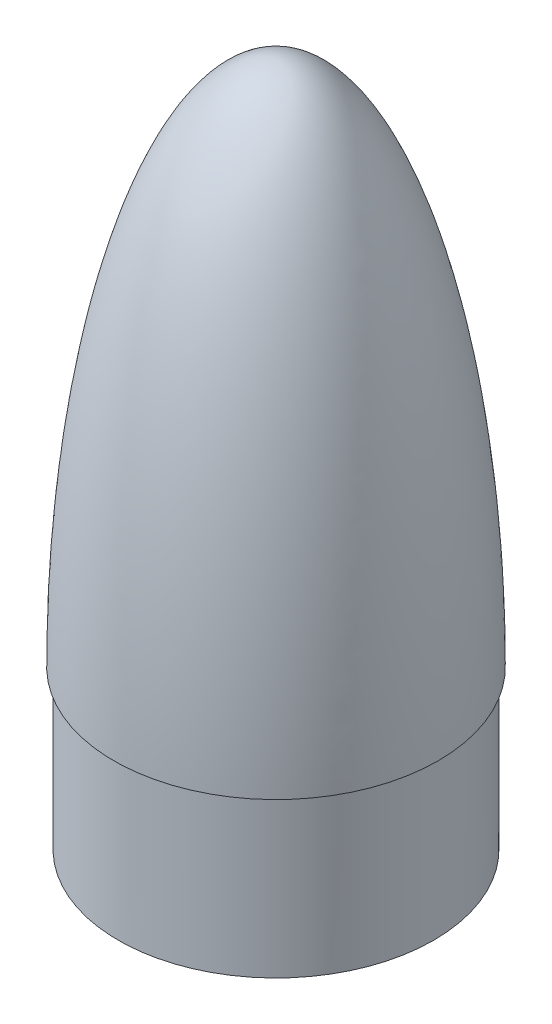
ISO-10303-21;
HEADER;
FILE_DESCRIPTION(('STEP AP214'),'2;1');
FILE_NAME('part.step','',(''),(''),'','','');
FILE_SCHEMA(('AUTOMOTIVE_DESIGN { 1 0 10303 214 1 1 1 1 }'));
ENDSEC;
DATA;
#1=APPLICATION_CONTEXT('core data for automotive mechanical design processes');
#2=APPLICATION_PROTOCOL_DEFINITION('international standard','automotive_design',2000,#1);
#3=PRODUCT_CONTEXT('',#1,'mechanical');
#4=PRODUCT('Part','Part','',(#3));
#5=PRODUCT_RELATED_PRODUCT_CATEGORY('part','',(#4));
#6=PRODUCT_DEFINITION_FORMATION('','',#4);
#7=PRODUCT_DEFINITION_CONTEXT('part definition',#1,'design');
#8=PRODUCT_DEFINITION('design','',#6,#7);
#9=PRODUCT_DEFINITION_SHAPE('','',#8);
#10=(LENGTH_UNIT() NAMED_UNIT(*) SI_UNIT(.MILLI.,.METRE.));
#11=(NAMED_UNIT(*) PLANE_ANGLE_UNIT() SI_UNIT($,.RADIAN.));
#12=(NAMED_UNIT(*) SI_UNIT($,.STERADIAN.) SOLID_ANGLE_UNIT());
#13=UNCERTAINTY_MEASURE_WITH_UNIT(LENGTH_MEASURE(1.E-05),#10,'distance_accuracy_value','');
#14=(GEOMETRIC_REPRESENTATION_CONTEXT(3) GLOBAL_UNCERTAINTY_ASSIGNED_CONTEXT((#13)) GLOBAL_UNIT_ASSIGNED_CONTEXT((#10,
#11,#12)) REPRESENTATION_CONTEXT('',''));
#15=CARTESIAN_POINT('',(0.,0.,0.));
#16=DIRECTION('',(0.,0.,1.));
#17=DIRECTION('',(1.,0.,0.));
#18=AXIS2_PLACEMENT_3D('',#15,#16,#17);
#19=CARTESIAN_POINT('',(78.359,-3.85523847188953E-12,0.));
#20=CARTESIAN_POINT('',(78.359,0.547287489075588,0.));
#21=CARTESIAN_POINT('',(78.3578456020913,1.64956361844569,0.));
#22=CARTESIAN_POINT('',(78.3526507757178,3.58634987510626,0.));
#23=CARTESIAN_POINT('',(78.3387963460281,5.98893459648296,0.));
#24=CARTESIAN_POINT('',(78.3180106719865,8.35221156862116,0.));
#25=CARTESIAN_POINT('',(78.2902889503954,10.7456008880464,0.));
#26=CARTESIAN_POINT('',(78.2469586970559,13.7314118256431,0.));
#27=CARTESIAN_POINT('',(78.1810613065712,17.3117033816035,0.));
#28=CARTESIAN_POINT('',(78.0838662599076,21.4904424666421,0.));
#29=CARTESIAN_POINT('',(77.9448220852113,26.2641170071195,0.));
#30=CARTESIAN_POINT('',(77.7776831858622,31.0375576311793,0.));
#31=CARTESIAN_POINT('',(77.5822913396883,35.809557456214,0.));
#32=CARTESIAN_POINT('',(77.358460438954,40.5805118631689,0.));
#33=CARTESIAN_POINT('',(77.0428534871404,46.5422862456611,0.));
#34=CARTESIAN_POINT('',(76.679080298482,52.501436143599,0.));
#35=CARTESIAN_POINT('',(76.2664485683162,58.4573591267082,0.));
#36=CARTESIAN_POINT('',(75.8041028056292,64.4096073987156,0.));
#37=CARTESIAN_POINT('',(75.4040152278983,69.1689496368718,0.));
#38=CARTESIAN_POINT('',(74.8656269280594,75.1147987012799,0.));
#39=CARTESIAN_POINT('',(74.1573857441951,82.2439739931216,0.));
#40=CARTESIAN_POINT('',(73.238266917693,90.5517309553179,0.));
#41=CARTESIAN_POINT('',(72.0557405970124,100.030771811018,0.));
#42=CARTESIAN_POINT('',(70.7355289433761,109.491671533595,0.));
#43=CARTESIAN_POINT('',(69.2709291178535,118.931305028362,0.));
#44=CARTESIAN_POINT('',(67.2499969191818,130.699881306212,0.));
#45=CARTESIAN_POINT('',(64.5017329483004,144.763840426727,0.));
#46=CARTESIAN_POINT('',(61.3085555382339,158.735984092255,0.));
#47=CARTESIAN_POINT('',(57.5910494958651,172.5772135738,0.));
#48=CARTESIAN_POINT('',(53.3830259383034,186.275905478581,0.));
#49=CARTESIAN_POINT('',(49.2387463120402,198.044837448618,0.));
#50=CARTESIAN_POINT('',(44.4832374304626,209.587335710993,0.));
#51=CARTESIAN_POINT('',(38.9428842352643,220.719241790241,0.));
#52=CARTESIAN_POINT('',(34.256173134855,228.693595393164,0.));
#53=CARTESIAN_POINT('',(29.8187102480322,235.095423042036,0.));
#54=CARTESIAN_POINT('',(25.6242497322616,240.182852142903,0.));
#55=CARTESIAN_POINT('',(21.9788928349695,243.926180276442,0.));
#56=CARTESIAN_POINT('',(18.5701501967581,246.859542722712,0.));
#57=CARTESIAN_POINT('',(15.4743490805522,249.076247660638,0.));
#58=CARTESIAN_POINT('',(12.5634057109101,250.785701438361,0.));
#59=CARTESIAN_POINT('',(9.77232736304578,252.083533870525,0.));
#60=CARTESIAN_POINT('',(7.06306970862824,253.028642362402,0.));
#61=CARTESIAN_POINT('',(4.27537380497181,253.686778480731,0.));
#62=CARTESIAN_POINT('',(2.18800688606533,253.939891173346,0.));
#63=CARTESIAN_POINT('',(0.767171585554602,253.999916554805,0.));
#64=CARTESIAN_POINT('',(0.,254.000000000081,0.));
#65=B_SPLINE_CURVE_WITH_KNOTS('',4,(#19,#20,#21,#22,#23,#24,#25,#26,#27,#28,#29,#30,#31,#32,#33,
#34,#35,#36,#37,#38,#39,#40,#41,#42,#43,#44,#45,#46,#47,#48,#49,#50,#51,#52,#53,#54,#55,#56,#57,
#58,#59,#60,#61,#62,#63,#64),.UNSPECIFIED.,.F.,.F.,(5,1,1,1,1,1,1,1,1,1,1,1,1,1,1,1,1,1,1,1,1,1,
1,1,1,1,1,1,1,1,1,1,1,1,1,1,1,1,1,1,1,1,5),(0.0832901678974378,0.0911196738198312,
0.0989491797422246,0.106778685664618,0.114608191587011,0.122437697509405,0.130267203431798,
0.145926215276585,0.161585227308661,0.177244239340738,0.192903251372814,0.208562263404891,
0.22422127500536,0.23988028660583,0.271198309806769,0.286857322025267,0.302516334243765,
0.318175346462263,0.333834358680761,0.365152382658847,0.396470406636932,0.427788430031848,
0.459106453426764,0.490424474288177,0.52174249514959,0.584378539310645,0.64701458132928,
0.678332609009811,0.709650636690343,0.772286631173186,0.810589211116004,0.841907031493423,
0.87260750281029,0.893486158308834,0.912628449807464,0.928287273750051,0.941044947751305,
0.952387223266141,0.962498308196118,0.972496120469674,0.981348672389275,0.98994985578346,1.),.UNSPECIFIED.);
#66=CARTESIAN_POINT('',(0.,254.000000000081,0.));
#67=DIRECTION('',(0.,1.,0.));
#68=AXIS1_PLACEMENT('',#66,#67);
#69=SURFACE_OF_REVOLUTION('',#65,#68);
#70=CARTESIAN_POINT('',(0.,254.000000000081,0.));
#71=VERTEX_POINT('',#70);
#72=VERTEX_LOOP('',#71);
#73=FACE_BOUND('',#72,.T.);
#74=CARTESIAN_POINT('',(0.,0.,0.));
#75=DIRECTION('',(0.,1.,0.));
#76=DIRECTION('',(-1.,0.,0.));
#77=AXIS2_PLACEMENT_3D('',#74,#75,#76);
#78=CIRCLE('',#77,78.359);
#79=CARTESIAN_POINT('',(-78.359,0.,0.));
#80=VERTEX_POINT('',#79);
#81=EDGE_CURVE('E44',#80,#80,#78,.T.);
#82=ORIENTED_EDGE('',*,*,#81,.T.);
#83=EDGE_LOOP('',(#82));
#84=FACE_BOUND('',#83,.T.);
#85=ADVANCED_FACE('F37',(#73,#84),#69,.T.);
#86=CARTESIAN_POINT('',(78.359,0.,0.));
#87=DIRECTION('',(0.,1.,0.));
#88=DIRECTION('',(-1.,0.,0.));
#89=AXIS2_PLACEMENT_3D('',#86,#87,#88);
#90=PLANE('',#89);
#91=CARTESIAN_POINT('',(0.,0.,0.));
#92=DIRECTION('',(0.,1.,0.));
#93=DIRECTION('',(-1.,0.,0.));
#94=AXIS2_PLACEMENT_3D('',#91,#92,#93);
#95=CIRCLE('',#94,76.2);
#96=CARTESIAN_POINT('',(-76.2,0.,0.));
#97=VERTEX_POINT('',#96);
#98=EDGE_CURVE('E11',#97,#97,#95,.F.);
#99=ORIENTED_EDGE('',*,*,#98,.F.);
#100=EDGE_LOOP('',(#99));
#101=FACE_BOUND('',#100,.T.);
#102=ORIENTED_EDGE('',*,*,#81,.F.);
#103=EDGE_LOOP('',(#102));
#104=FACE_BOUND('',#103,.T.);
#105=ADVANCED_FACE('F49',(#101,#104),#90,.F.);
#106=CARTESIAN_POINT('',(0.,-76.2,0.));
#107=DIRECTION('',(0.,1.,0.));
#108=DIRECTION('',(-1.,0.,0.));
#109=AXIS2_PLACEMENT_3D('',#106,#107,#108);
#110=CYLINDRICAL_SURFACE('',#109,76.2);
#111=CARTESIAN_POINT('',(0.,-76.2,0.));
#112=DIRECTION('',(0.,-1.,0.));
#113=DIRECTION('',(1.,0.,0.));
#114=AXIS2_PLACEMENT_3D('',#111,#112,#113);
#115=CIRCLE('',#114,76.2);
#116=CARTESIAN_POINT('',(76.2,-76.2,0.));
#117=VERTEX_POINT('',#116);
#118=EDGE_CURVE('E53',#117,#117,#115,.T.);
#119=ORIENTED_EDGE('',*,*,#118,.F.);
#120=EDGE_LOOP('',(#119));
#121=FACE_BOUND('',#120,.T.);
#122=ORIENTED_EDGE('',*,*,#98,.T.);
#123=EDGE_LOOP('',(#122));
#124=FACE_BOUND('',#123,.T.);
#125=ADVANCED_FACE('F66',(#121,#124),#110,.T.);
#126=CARTESIAN_POINT('',(0.,-76.2,0.));
#127=DIRECTION('',(0.,-1.,0.));
#128=DIRECTION('',(1.,0.,0.));
#129=AXIS2_PLACEMENT_3D('',#126,#127,#128);
#130=PLANE('',#129);
#131=ORIENTED_EDGE('',*,*,#118,.T.);
#132=EDGE_LOOP('',(#131));
#133=FACE_BOUND('',#132,.T.);
#134=ADVANCED_FACE('F64',(#133),#130,.T.);
#135=CLOSED_SHELL('',(#85,#105,#125,#134));
#136=MANIFOLD_SOLID_BREP('B2',#135);
#137=ADVANCED_BREP_SHAPE_REPRESENTATION('',(#18,#136),#14);
#138=SHAPE_DEFINITION_REPRESENTATION(#9,#137);
ENDSEC;
END-ISO-10303-21;
